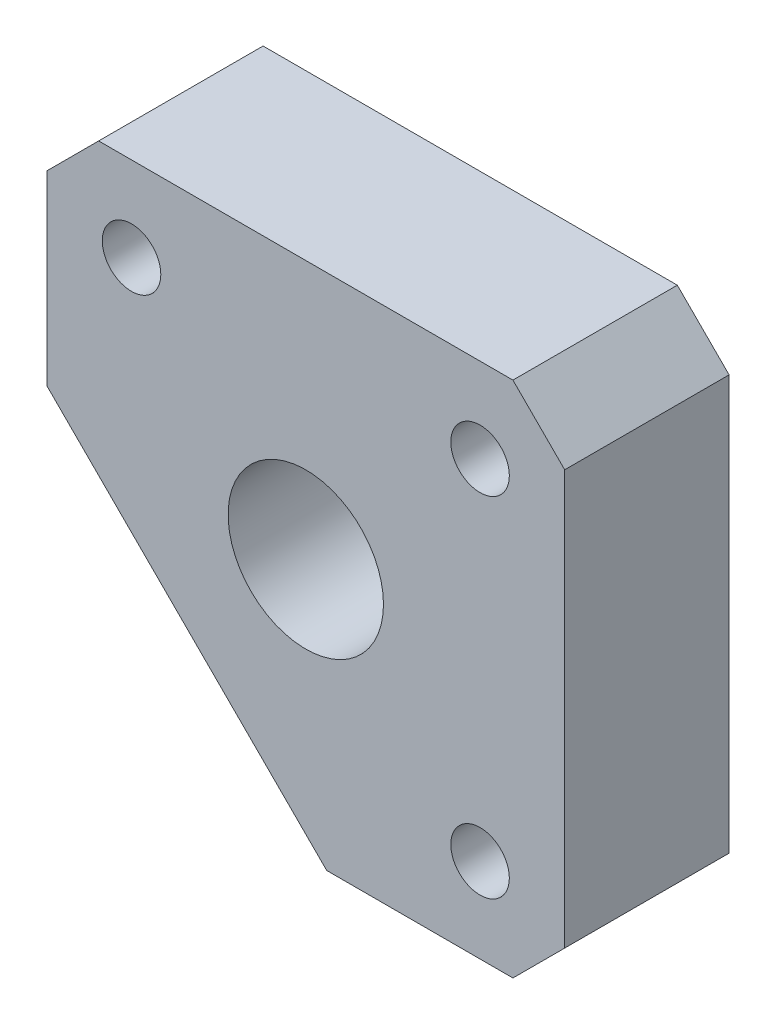
ISO-10303-21;
HEADER;
FILE_DESCRIPTION(('STEP AP214'),'2;1');
FILE_NAME('part.step','',(''),(''),'','','');
FILE_SCHEMA(('AUTOMOTIVE_DESIGN { 1 0 10303 214 1 1 1 1 }'));
ENDSEC;
DATA;
#1=APPLICATION_CONTEXT('core data for automotive mechanical design processes');
#2=APPLICATION_PROTOCOL_DEFINITION('international standard','automotive_design',2000,#1);
#3=PRODUCT_CONTEXT('',#1,'mechanical');
#4=PRODUCT('Part','Part','',(#3));
#5=PRODUCT_RELATED_PRODUCT_CATEGORY('part','',(#4));
#6=PRODUCT_DEFINITION_FORMATION('','',#4);
#7=PRODUCT_DEFINITION_CONTEXT('part definition',#1,'design');
#8=PRODUCT_DEFINITION('design','',#6,#7);
#9=PRODUCT_DEFINITION_SHAPE('','',#8);
#10=(LENGTH_UNIT() NAMED_UNIT(*) SI_UNIT(.MILLI.,.METRE.));
#11=(NAMED_UNIT(*) PLANE_ANGLE_UNIT() SI_UNIT($,.RADIAN.));
#12=(NAMED_UNIT(*) SI_UNIT($,.STERADIAN.) SOLID_ANGLE_UNIT());
#13=UNCERTAINTY_MEASURE_WITH_UNIT(LENGTH_MEASURE(1.E-05),#10,'distance_accuracy_value','');
#14=(GEOMETRIC_REPRESENTATION_CONTEXT(3) GLOBAL_UNCERTAINTY_ASSIGNED_CONTEXT((#13)) GLOBAL_UNIT_ASSIGNED_CONTEXT((#10,
#11,#12)) REPRESENTATION_CONTEXT('',''));
#15=CARTESIAN_POINT('',(0.,0.,0.));
#16=DIRECTION('',(0.,0.,1.));
#17=DIRECTION('',(1.,0.,0.));
#18=AXIS2_PLACEMENT_3D('',#15,#16,#17);
#19=CARTESIAN_POINT('',(0.,0.,6.35));
#20=DIRECTION('',(0.,0.,1.));
#21=DIRECTION('',(1.,0.,0.));
#22=AXIS2_PLACEMENT_3D('',#19,#20,#21);
#23=PLANE('',#22);
#24=CARTESIAN_POINT('',(-6.731,6.731,6.35));
#25=DIRECTION('',(0.,0.,1.));
#26=DIRECTION('',(1.,0.,0.));
#27=AXIS2_PLACEMENT_3D('',#24,#25,#26);
#28=CIRCLE('',#27,1.13029999999999);
#29=CARTESIAN_POINT('',(-5.60070000000001,6.731,6.35));
#30=VERTEX_POINT('',#29);
#31=EDGE_CURVE('E192',#30,#30,#28,.T.);
#32=ORIENTED_EDGE('',*,*,#31,.F.);
#33=EDGE_LOOP('',(#32));
#34=FACE_BOUND('',#33,.T.);
#35=CARTESIAN_POINT('',(6.731,-6.731,6.35));
#36=DIRECTION('',(0.,0.,1.));
#37=DIRECTION('',(1.,0.,0.));
#38=AXIS2_PLACEMENT_3D('',#35,#36,#37);
#39=CIRCLE('',#38,1.13029999999999);
#40=CARTESIAN_POINT('',(7.86129999999999,-6.731,6.35));
#41=VERTEX_POINT('',#40);
#42=EDGE_CURVE('E186',#41,#41,#39,.T.);
#43=ORIENTED_EDGE('',*,*,#42,.F.);
#44=EDGE_LOOP('',(#43));
#45=FACE_BOUND('',#44,.T.);
#46=CARTESIAN_POINT('',(6.731,6.731,6.35));
#47=DIRECTION('',(0.,0.,1.));
#48=DIRECTION('',(1.,0.,0.));
#49=AXIS2_PLACEMENT_3D('',#46,#47,#48);
#50=CIRCLE('',#49,1.13029999999999);
#51=CARTESIAN_POINT('',(7.86129999999999,6.731,6.35));
#52=VERTEX_POINT('',#51);
#53=EDGE_CURVE('E180',#52,#52,#50,.T.);
#54=ORIENTED_EDGE('',*,*,#53,.F.);
#55=EDGE_LOOP('',(#54));
#56=FACE_BOUND('',#55,.T.);
#57=DIRECTION('',(1.,0.,0.));
#58=VECTOR('',#57,1.);
#59=CARTESIAN_POINT('',(0.807611844574865,-10.,6.35));
#60=LINE('',#59,#58);
#61=CARTESIAN_POINT('',(0.807611844574865,-10.,6.35));
#62=VERTEX_POINT('',#61);
#63=CARTESIAN_POINT('',(7.99999999999999,-10.,6.35));
#64=VERTEX_POINT('',#63);
#65=EDGE_CURVE('E120',#62,#64,#60,.T.);
#66=ORIENTED_EDGE('',*,*,#65,.T.);
#67=DIRECTION('',(-0.707106781186549,-0.707106781186546,0.));
#68=VECTOR('',#67,1.);
#69=CARTESIAN_POINT('',(8.99999999999997,-9.00000000000002,6.35));
#70=LINE('',#69,#68);
#71=CARTESIAN_POINT('',(10.,-7.99999999999999,6.35));
#72=VERTEX_POINT('',#71);
#73=EDGE_CURVE('E146',#64,#72,#70,.F.);
#74=ORIENTED_EDGE('',*,*,#73,.T.);
#75=DIRECTION('',(0.,1.,0.));
#76=VECTOR('',#75,1.);
#77=CARTESIAN_POINT('',(10.,10.,6.35));
#78=LINE('',#77,#76);
#79=CARTESIAN_POINT('',(10.,7.99999999999999,6.35));
#80=VERTEX_POINT('',#79);
#81=EDGE_CURVE('E169',#72,#80,#78,.T.);
#82=ORIENTED_EDGE('',*,*,#81,.T.);
#83=DIRECTION('',(0.707106781186546,-0.707106781186549,0.));
#84=VECTOR('',#83,1.);
#85=CARTESIAN_POINT('',(9.00000000000002,8.99999999999998,6.35));
#86=LINE('',#85,#84);
#87=CARTESIAN_POINT('',(8.,10.,6.35));
#88=VERTEX_POINT('',#87);
#89=EDGE_CURVE('E57',#80,#88,#86,.F.);
#90=ORIENTED_EDGE('',*,*,#89,.T.);
#91=DIRECTION('',(-1.,0.,0.));
#92=VECTOR('',#91,1.);
#93=CARTESIAN_POINT('',(-10.,10.,6.35));
#94=LINE('',#93,#92);
#95=CARTESIAN_POINT('',(-7.99999999999998,10.,6.35));
#96=VERTEX_POINT('',#95);
#97=EDGE_CURVE('E130',#88,#96,#94,.T.);
#98=ORIENTED_EDGE('',*,*,#97,.T.);
#99=DIRECTION('',(0.707106781186549,0.707106781186546,0.));
#100=VECTOR('',#99,1.);
#101=CARTESIAN_POINT('',(-8.99999999999997,9.00000000000002,6.35));
#102=LINE('',#101,#100);
#103=CARTESIAN_POINT('',(-10.,8.,6.35));
#104=VERTEX_POINT('',#103);
#105=EDGE_CURVE('E107',#96,#104,#102,.F.);
#106=ORIENTED_EDGE('',*,*,#105,.T.);
#107=DIRECTION('',(0.,-1.,0.));
#108=VECTOR('',#107,1.);
#109=CARTESIAN_POINT('',(-10.,10.,6.35));
#110=LINE('',#109,#108);
#111=CARTESIAN_POINT('',(-10.,0.807611844574901,6.35));
#112=VERTEX_POINT('',#111);
#113=EDGE_CURVE('E100',#104,#112,#110,.T.);
#114=ORIENTED_EDGE('',*,*,#113,.T.);
#115=DIRECTION('',(0.707106781186546,-0.707106781186549,0.));
#116=VECTOR('',#115,1.);
#117=CARTESIAN_POINT('',(-10.,0.807611844574901,6.35));
#118=LINE('',#117,#116);
#119=EDGE_CURVE('E104',#112,#62,#118,.T.);
#120=ORIENTED_EDGE('',*,*,#119,.T.);
#121=EDGE_LOOP('',(#66,#74,#82,#90,#98,#106,#114,#120));
#122=FACE_BOUND('',#121,.T.);
#123=CARTESIAN_POINT('',(0.,0.,6.35));
#124=DIRECTION('',(0.,0.,1.));
#125=DIRECTION('',(1.,0.,0.));
#126=AXIS2_PLACEMENT_3D('',#123,#124,#125);
#127=CIRCLE('',#126,3.);
#128=CARTESIAN_POINT('',(3.,0.,6.35));
#129=VERTEX_POINT('',#128);
#130=EDGE_CURVE('E167',#129,#129,#127,.T.);
#131=ORIENTED_EDGE('',*,*,#130,.F.);
#132=EDGE_LOOP('',(#131));
#133=FACE_BOUND('',#132,.T.);
#134=ADVANCED_FACE('F35',(#34,#45,#56,#122,#133),#23,.T.);
#135=CARTESIAN_POINT('',(0.,0.,0.));
#136=DIRECTION('',(0.,0.,1.));
#137=DIRECTION('',(1.,0.,0.));
#138=AXIS2_PLACEMENT_3D('',#135,#136,#137);
#139=PLANE('',#138);
#140=CARTESIAN_POINT('',(-6.731,6.731,0.));
#141=DIRECTION('',(0.,0.,1.));
#142=DIRECTION('',(1.,0.,0.));
#143=AXIS2_PLACEMENT_3D('',#140,#141,#142);
#144=CIRCLE('',#143,1.1303);
#145=CARTESIAN_POINT('',(-5.6007,6.731,0.));
#146=VERTEX_POINT('',#145);
#147=EDGE_CURVE('E189',#146,#146,#144,.T.);
#148=ORIENTED_EDGE('',*,*,#147,.T.);
#149=EDGE_LOOP('',(#148));
#150=FACE_BOUND('',#149,.T.);
#151=CARTESIAN_POINT('',(6.731,-6.731,0.));
#152=DIRECTION('',(0.,0.,1.));
#153=DIRECTION('',(1.,0.,0.));
#154=AXIS2_PLACEMENT_3D('',#151,#152,#153);
#155=CIRCLE('',#154,1.1303);
#156=CARTESIAN_POINT('',(7.8613,-6.731,0.));
#157=VERTEX_POINT('',#156);
#158=EDGE_CURVE('E183',#157,#157,#155,.T.);
#159=ORIENTED_EDGE('',*,*,#158,.T.);
#160=EDGE_LOOP('',(#159));
#161=FACE_BOUND('',#160,.T.);
#162=CARTESIAN_POINT('',(6.731,6.731,0.));
#163=DIRECTION('',(0.,0.,1.));
#164=DIRECTION('',(1.,0.,0.));
#165=AXIS2_PLACEMENT_3D('',#162,#163,#164);
#166=CIRCLE('',#165,1.1303);
#167=CARTESIAN_POINT('',(7.8613,6.731,0.));
#168=VERTEX_POINT('',#167);
#169=EDGE_CURVE('E175',#168,#168,#166,.T.);
#170=ORIENTED_EDGE('',*,*,#169,.T.);
#171=EDGE_LOOP('',(#170));
#172=FACE_BOUND('',#171,.T.);
#173=DIRECTION('',(0.,1.,0.));
#174=VECTOR('',#173,1.);
#175=CARTESIAN_POINT('',(10.,10.,0.));
#176=LINE('',#175,#174);
#177=CARTESIAN_POINT('',(10.,-7.99999999999999,0.));
#178=VERTEX_POINT('',#177);
#179=CARTESIAN_POINT('',(10.,7.99999999999999,0.));
#180=VERTEX_POINT('',#179);
#181=EDGE_CURVE('E158',#178,#180,#176,.T.);
#182=ORIENTED_EDGE('',*,*,#181,.F.);
#183=DIRECTION('',(0.707106781186549,0.707106781186546,0.));
#184=VECTOR('',#183,1.);
#185=CARTESIAN_POINT('',(10.,-7.99999999999999,0.));
#186=LINE('',#185,#184);
#187=CARTESIAN_POINT('',(7.99999999999999,-10.,0.));
#188=VERTEX_POINT('',#187);
#189=EDGE_CURVE('E140',#178,#188,#186,.F.);
#190=ORIENTED_EDGE('',*,*,#189,.T.);
#191=DIRECTION('',(1.,0.,0.));
#192=VECTOR('',#191,1.);
#193=CARTESIAN_POINT('',(0.807611844574865,-10.,0.));
#194=LINE('',#193,#192);
#195=CARTESIAN_POINT('',(0.807611844574865,-10.,0.));
#196=VERTEX_POINT('',#195);
#197=EDGE_CURVE('E159',#196,#188,#194,.T.);
#198=ORIENTED_EDGE('',*,*,#197,.F.);
#199=DIRECTION('',(0.707106781186546,-0.707106781186549,0.));
#200=VECTOR('',#199,1.);
#201=CARTESIAN_POINT('',(-10.,0.807611844574901,0.));
#202=LINE('',#201,#200);
#203=CARTESIAN_POINT('',(-10.,0.807611844574901,0.));
#204=VERTEX_POINT('',#203);
#205=EDGE_CURVE('E164',#204,#196,#202,.T.);
#206=ORIENTED_EDGE('',*,*,#205,.F.);
#207=DIRECTION('',(0.,-1.,0.));
#208=VECTOR('',#207,1.);
#209=CARTESIAN_POINT('',(-10.,10.,0.));
#210=LINE('',#209,#208);
#211=CARTESIAN_POINT('',(-10.,8.,0.));
#212=VERTEX_POINT('',#211);
#213=EDGE_CURVE('E124',#212,#204,#210,.T.);
#214=ORIENTED_EDGE('',*,*,#213,.F.);
#215=DIRECTION('',(-0.707106781186549,-0.707106781186546,0.));
#216=VECTOR('',#215,1.);
#217=CARTESIAN_POINT('',(-10.,7.99999999999999,0.));
#218=LINE('',#217,#216);
#219=CARTESIAN_POINT('',(-7.99999999999998,10.,0.));
#220=VERTEX_POINT('',#219);
#221=EDGE_CURVE('E136',#212,#220,#218,.F.);
#222=ORIENTED_EDGE('',*,*,#221,.T.);
#223=DIRECTION('',(-1.,0.,0.));
#224=VECTOR('',#223,1.);
#225=CARTESIAN_POINT('',(-10.,10.,0.));
#226=LINE('',#225,#224);
#227=CARTESIAN_POINT('',(8.,10.,0.));
#228=VERTEX_POINT('',#227);
#229=EDGE_CURVE('E111',#228,#220,#226,.T.);
#230=ORIENTED_EDGE('',*,*,#229,.F.);
#231=DIRECTION('',(-0.707106781186546,0.707106781186549,0.));
#232=VECTOR('',#231,1.);
#233=CARTESIAN_POINT('',(8.,10.,0.));
#234=LINE('',#233,#232);
#235=EDGE_CURVE('E138',#228,#180,#234,.F.);
#236=ORIENTED_EDGE('',*,*,#235,.T.);
#237=EDGE_LOOP('',(#182,#190,#198,#206,#214,#222,#230,#236));
#238=FACE_BOUND('',#237,.T.);
#239=CARTESIAN_POINT('',(0.,0.,0.));
#240=DIRECTION('',(0.,0.,1.));
#241=DIRECTION('',(1.,0.,0.));
#242=AXIS2_PLACEMENT_3D('',#239,#240,#241);
#243=CIRCLE('',#242,3.);
#244=CARTESIAN_POINT('',(3.,0.,0.));
#245=VERTEX_POINT('',#244);
#246=EDGE_CURVE('E172',#245,#245,#243,.T.);
#247=ORIENTED_EDGE('',*,*,#246,.T.);
#248=EDGE_LOOP('',(#247));
#249=FACE_BOUND('',#248,.T.);
#250=ADVANCED_FACE('F155',(#150,#161,#172,#238,#249),#139,.F.);
#251=CARTESIAN_POINT('',(-10.,10.,6.35));
#252=DIRECTION('',(1.,0.,0.));
#253=DIRECTION('',(0.,0.,-1.));
#254=AXIS2_PLACEMENT_3D('',#251,#252,#253);
#255=PLANE('',#254);
#256=ORIENTED_EDGE('',*,*,#113,.F.);
#257=DIRECTION('',(0.,0.,-1.));
#258=VECTOR('',#257,1.);
#259=CARTESIAN_POINT('',(-10.,7.99999999999999,6.35));
#260=LINE('',#259,#258);
#261=EDGE_CURVE('E11',#104,#212,#260,.T.);
#262=ORIENTED_EDGE('',*,*,#261,.T.);
#263=ORIENTED_EDGE('',*,*,#213,.T.);
#264=DIRECTION('',(0.,0.,-1.));
#265=VECTOR('',#264,1.);
#266=CARTESIAN_POINT('',(-10.,0.807611844574901,6.35));
#267=LINE('',#266,#265);
#268=EDGE_CURVE('E116',#112,#204,#267,.T.);
#269=ORIENTED_EDGE('',*,*,#268,.F.);
#270=EDGE_LOOP('',(#256,#262,#263,#269));
#271=FACE_BOUND('',#270,.T.);
#272=ADVANCED_FACE('F122',(#271),#255,.F.);
#273=CARTESIAN_POINT('',(-10.,0.807611844574901,6.35));
#274=DIRECTION('',(0.707106781186549,0.707106781186546,0.));
#275=DIRECTION('',(-0.707106781186546,0.707106781186549,0.));
#276=AXIS2_PLACEMENT_3D('',#273,#274,#275);
#277=PLANE('',#276);
#278=ORIENTED_EDGE('',*,*,#205,.T.);
#279=DIRECTION('',(0.,0.,-1.));
#280=VECTOR('',#279,1.);
#281=CARTESIAN_POINT('',(0.807611844574865,-10.,6.35));
#282=LINE('',#281,#280);
#283=EDGE_CURVE('E118',#62,#196,#282,.T.);
#284=ORIENTED_EDGE('',*,*,#283,.F.);
#285=ORIENTED_EDGE('',*,*,#119,.F.);
#286=ORIENTED_EDGE('',*,*,#268,.T.);
#287=EDGE_LOOP('',(#278,#284,#285,#286));
#288=FACE_BOUND('',#287,.T.);
#289=ADVANCED_FACE('F115',(#288),#277,.F.);
#290=CARTESIAN_POINT('',(0.807611844574865,-10.,6.35));
#291=DIRECTION('',(0.,1.,0.));
#292=DIRECTION('',(0.,0.,1.));
#293=AXIS2_PLACEMENT_3D('',#290,#291,#292);
#294=PLANE('',#293);
#295=ORIENTED_EDGE('',*,*,#197,.T.);
#296=DIRECTION('',(0.,0.,1.));
#297=VECTOR('',#296,1.);
#298=CARTESIAN_POINT('',(7.99999999999999,-10.,6.35));
#299=LINE('',#298,#297);
#300=EDGE_CURVE('E142',#188,#64,#299,.T.);
#301=ORIENTED_EDGE('',*,*,#300,.T.);
#302=ORIENTED_EDGE('',*,*,#65,.F.);
#303=ORIENTED_EDGE('',*,*,#283,.T.);
#304=EDGE_LOOP('',(#295,#301,#302,#303));
#305=FACE_BOUND('',#304,.T.);
#306=ADVANCED_FACE('F230',(#305),#294,.F.);
#307=CARTESIAN_POINT('',(10.,10.,6.35));
#308=DIRECTION('',(-1.,0.,0.));
#309=DIRECTION('',(0.,0.,1.));
#310=AXIS2_PLACEMENT_3D('',#307,#308,#309);
#311=PLANE('',#310);
#312=ORIENTED_EDGE('',*,*,#81,.F.);
#313=DIRECTION('',(0.,0.,-1.));
#314=VECTOR('',#313,1.);
#315=CARTESIAN_POINT('',(10.,-7.99999999999999,6.35));
#316=LINE('',#315,#314);
#317=EDGE_CURVE('E128',#72,#178,#316,.T.);
#318=ORIENTED_EDGE('',*,*,#317,.T.);
#319=ORIENTED_EDGE('',*,*,#181,.T.);
#320=DIRECTION('',(0.,0.,1.));
#321=VECTOR('',#320,1.);
#322=CARTESIAN_POINT('',(10.,7.99999999999999,6.35));
#323=LINE('',#322,#321);
#324=EDGE_CURVE('E126',#180,#80,#323,.T.);
#325=ORIENTED_EDGE('',*,*,#324,.T.);
#326=EDGE_LOOP('',(#312,#318,#319,#325));
#327=FACE_BOUND('',#326,.T.);
#328=ADVANCED_FACE('F227',(#327),#311,.F.);
#329=CARTESIAN_POINT('',(-10.,10.,6.35));
#330=DIRECTION('',(0.,-1.,0.));
#331=DIRECTION('',(0.,0.,-1.));
#332=AXIS2_PLACEMENT_3D('',#329,#330,#331);
#333=PLANE('',#332);
#334=ORIENTED_EDGE('',*,*,#97,.F.);
#335=DIRECTION('',(0.,0.,-1.));
#336=VECTOR('',#335,1.);
#337=CARTESIAN_POINT('',(8.,10.,6.35));
#338=LINE('',#337,#336);
#339=EDGE_CURVE('E43',#88,#228,#338,.T.);
#340=ORIENTED_EDGE('',*,*,#339,.T.);
#341=ORIENTED_EDGE('',*,*,#229,.T.);
#342=DIRECTION('',(0.,0.,1.));
#343=VECTOR('',#342,1.);
#344=CARTESIAN_POINT('',(-7.99999999999998,10.,6.35));
#345=LINE('',#344,#343);
#346=EDGE_CURVE('E50',#220,#96,#345,.T.);
#347=ORIENTED_EDGE('',*,*,#346,.T.);
#348=EDGE_LOOP('',(#334,#340,#341,#347));
#349=FACE_BOUND('',#348,.T.);
#350=ADVANCED_FACE('F151',(#349),#333,.F.);
#351=CARTESIAN_POINT('',(0.,0.,6.35));
#352=DIRECTION('',(0.,0.,-1.));
#353=DIRECTION('',(-1.,0.,0.));
#354=AXIS2_PLACEMENT_3D('',#351,#352,#353);
#355=CYLINDRICAL_SURFACE('',#354,3.);
#356=ORIENTED_EDGE('',*,*,#130,.T.);
#357=EDGE_LOOP('',(#356));
#358=FACE_BOUND('',#357,.T.);
#359=ORIENTED_EDGE('',*,*,#246,.F.);
#360=EDGE_LOOP('',(#359));
#361=FACE_BOUND('',#360,.T.);
#362=ADVANCED_FACE('F208',(#358,#361),#355,.F.);
#363=CARTESIAN_POINT('',(6.731,6.731,6.35));
#364=DIRECTION('',(0.,0.,1.));
#365=DIRECTION('',(1.,0.,0.));
#366=AXIS2_PLACEMENT_3D('',#363,#364,#365);
#367=CYLINDRICAL_SURFACE('',#366,1.13029999999999);
#368=ORIENTED_EDGE('',*,*,#169,.F.);
#369=EDGE_LOOP('',(#368));
#370=FACE_BOUND('',#369,.T.);
#371=ORIENTED_EDGE('',*,*,#53,.T.);
#372=EDGE_LOOP('',(#371));
#373=FACE_BOUND('',#372,.T.);
#374=ADVANCED_FACE('F205',(#370,#373),#367,.F.);
#375=CARTESIAN_POINT('',(6.731,-6.731,6.35));
#376=DIRECTION('',(0.,0.,1.));
#377=DIRECTION('',(1.,0.,0.));
#378=AXIS2_PLACEMENT_3D('',#375,#376,#377);
#379=CYLINDRICAL_SURFACE('',#378,1.13029999999999);
#380=ORIENTED_EDGE('',*,*,#158,.F.);
#381=EDGE_LOOP('',(#380));
#382=FACE_BOUND('',#381,.T.);
#383=ORIENTED_EDGE('',*,*,#42,.T.);
#384=EDGE_LOOP('',(#383));
#385=FACE_BOUND('',#384,.T.);
#386=ADVANCED_FACE('F207',(#382,#385),#379,.F.);
#387=CARTESIAN_POINT('',(-6.731,6.731,6.35));
#388=DIRECTION('',(0.,0.,1.));
#389=DIRECTION('',(1.,0.,0.));
#390=AXIS2_PLACEMENT_3D('',#387,#388,#389);
#391=CYLINDRICAL_SURFACE('',#390,1.13029999999999);
#392=ORIENTED_EDGE('',*,*,#147,.F.);
#393=EDGE_LOOP('',(#392));
#394=FACE_BOUND('',#393,.T.);
#395=ORIENTED_EDGE('',*,*,#31,.T.);
#396=EDGE_LOOP('',(#395));
#397=FACE_BOUND('',#396,.T.);
#398=ADVANCED_FACE('F196',(#394,#397),#391,.F.);
#399=CARTESIAN_POINT('',(10.,-7.99999999999999,6.35));
#400=DIRECTION('',(-0.707106781186546,0.707106781186549,0.));
#401=DIRECTION('',(0.,0.,-1.));
#402=AXIS2_PLACEMENT_3D('',#399,#400,#401);
#403=PLANE('',#402);
#404=ORIENTED_EDGE('',*,*,#73,.F.);
#405=ORIENTED_EDGE('',*,*,#300,.F.);
#406=ORIENTED_EDGE('',*,*,#189,.F.);
#407=ORIENTED_EDGE('',*,*,#317,.F.);
#408=EDGE_LOOP('',(#404,#405,#406,#407));
#409=FACE_BOUND('',#408,.T.);
#410=ADVANCED_FACE('F239',(#409),#403,.F.);
#411=CARTESIAN_POINT('',(8.,10.,6.35));
#412=DIRECTION('',(-0.707106781186549,-0.707106781186546,0.));
#413=DIRECTION('',(0.,0.,-1.));
#414=AXIS2_PLACEMENT_3D('',#411,#412,#413);
#415=PLANE('',#414);
#416=ORIENTED_EDGE('',*,*,#89,.F.);
#417=ORIENTED_EDGE('',*,*,#324,.F.);
#418=ORIENTED_EDGE('',*,*,#235,.F.);
#419=ORIENTED_EDGE('',*,*,#339,.F.);
#420=EDGE_LOOP('',(#416,#417,#418,#419));
#421=FACE_BOUND('',#420,.T.);
#422=ADVANCED_FACE('F241',(#421),#415,.F.);
#423=CARTESIAN_POINT('',(-10.,7.99999999999999,6.35));
#424=DIRECTION('',(0.707106781186546,-0.707106781186549,0.));
#425=DIRECTION('',(0.,0.,-1.));
#426=AXIS2_PLACEMENT_3D('',#423,#424,#425);
#427=PLANE('',#426);
#428=ORIENTED_EDGE('',*,*,#105,.F.);
#429=ORIENTED_EDGE('',*,*,#346,.F.);
#430=ORIENTED_EDGE('',*,*,#221,.F.);
#431=ORIENTED_EDGE('',*,*,#261,.F.);
#432=EDGE_LOOP('',(#428,#429,#430,#431));
#433=FACE_BOUND('',#432,.T.);
#434=ADVANCED_FACE('F37',(#433),#427,.F.);
#435=CLOSED_SHELL('',(#134,#250,#272,#289,#306,#328,#350,#362,#374,#386,#398,#410,#422,#434));
#436=MANIFOLD_SOLID_BREP('B2',#435);
#437=ADVANCED_BREP_SHAPE_REPRESENTATION('',(#18,#436),#14);
#438=SHAPE_DEFINITION_REPRESENTATION(#9,#437);
ENDSEC;
END-ISO-10303-21;
